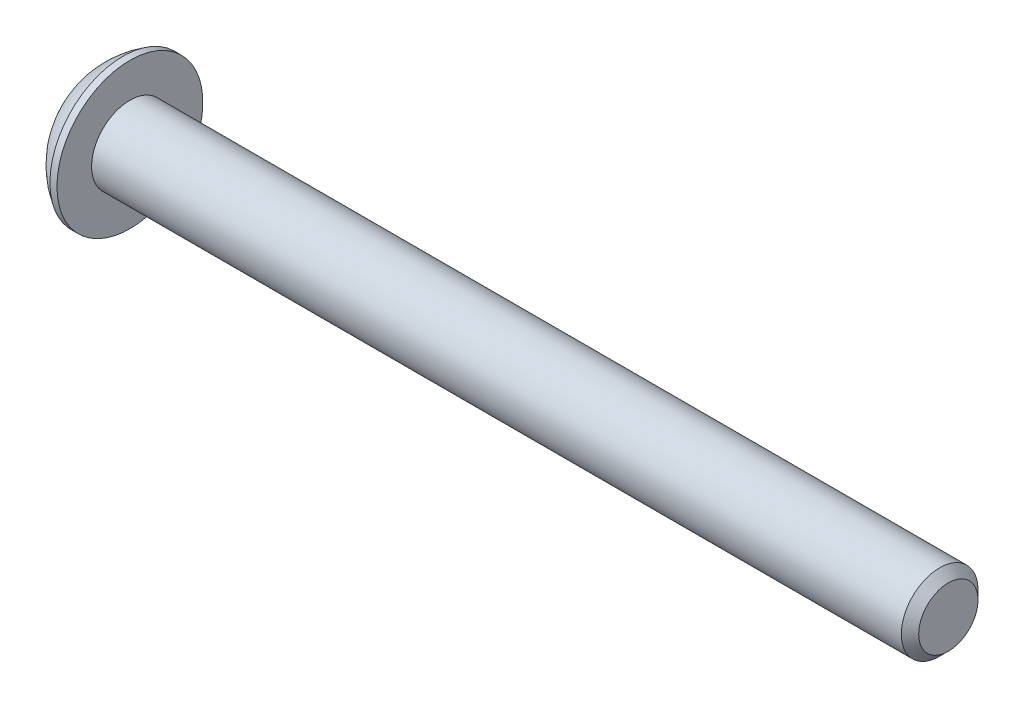
ISO-10303-21;
HEADER;
FILE_DESCRIPTION(('STEP AP214'),'2;1');
FILE_NAME('part.step','',(''),(''),'','','');
FILE_SCHEMA(('AUTOMOTIVE_DESIGN { 1 0 10303 214 1 1 1 1 }'));
ENDSEC;
DATA;
#1=APPLICATION_CONTEXT('core data for automotive mechanical design processes');
#2=APPLICATION_PROTOCOL_DEFINITION('international standard','automotive_design',2000,#1);
#3=PRODUCT_CONTEXT('',#1,'mechanical');
#4=PRODUCT('Part','Part','',(#3));
#5=PRODUCT_RELATED_PRODUCT_CATEGORY('part','',(#4));
#6=PRODUCT_DEFINITION_FORMATION('','',#4);
#7=PRODUCT_DEFINITION_CONTEXT('part definition',#1,'design');
#8=PRODUCT_DEFINITION('design','',#6,#7);
#9=PRODUCT_DEFINITION_SHAPE('','',#8);
#10=(LENGTH_UNIT() NAMED_UNIT(*) SI_UNIT(.MILLI.,.METRE.));
#11=(NAMED_UNIT(*) PLANE_ANGLE_UNIT() SI_UNIT($,.RADIAN.));
#12=(NAMED_UNIT(*) SI_UNIT($,.STERADIAN.) SOLID_ANGLE_UNIT());
#13=UNCERTAINTY_MEASURE_WITH_UNIT(LENGTH_MEASURE(1.E-05),#10,'distance_accuracy_value','');
#14=(GEOMETRIC_REPRESENTATION_CONTEXT(3) GLOBAL_UNCERTAINTY_ASSIGNED_CONTEXT((#13)) GLOBAL_UNIT_ASSIGNED_CONTEXT((#10,
#11,#12)) REPRESENTATION_CONTEXT('',''));
#15=CARTESIAN_POINT('',(0.,0.,0.));
#16=DIRECTION('',(0.,0.,1.));
#17=DIRECTION('',(1.,0.,0.));
#18=AXIS2_PLACEMENT_3D('',#15,#16,#17);
#19=CARTESIAN_POINT('',(1.32079999432833,0.,0.));
#20=DIRECTION('',(-1.,0.,0.));
#21=DIRECTION('',(0.,0.,1.));
#22=AXIS2_PLACEMENT_3D('',#19,#20,#21);
#23=CONICAL_SURFACE('',#22,1.19379999672553,1.04719755119985);
#24=CARTESIAN_POINT('',(2.01004074379096,0.,-4.44089209850063E-13));
#25=VERTEX_POINT('',#24);
#26=VERTEX_LOOP('',#25);
#27=FACE_BOUND('',#26,.T.);
#28=CARTESIAN_POINT('',(1.3207999943284,0.,0.));
#29=DIRECTION('',(-1.,0.,0.));
#30=DIRECTION('',(0.,0.,1.));
#31=AXIS2_PLACEMENT_3D('',#28,#29,#30);
#32=CIRCLE('',#31,1.19379999672553);
#33=CARTESIAN_POINT('',(1.3207999971642,0.,1.19379999836265));
#34=VERTEX_POINT('',#33);
#35=CARTESIAN_POINT('',(1.3207999971635,-1.03386112562127,0.596899999183897));
#36=VERTEX_POINT('',#35);
#37=EDGE_CURVE('E20',#34,#36,#32,.F.);
#38=ORIENTED_EDGE('',*,*,#37,.F.);
#39=CARTESIAN_POINT('',(1.32079999432935,0.,0.));
#40=DIRECTION('',(-1.,0.,0.));
#41=DIRECTION('',(0.,0.,1.));
#42=AXIS2_PLACEMENT_3D('',#39,#40,#41);
#43=CIRCLE('',#42,1.19379999672375);
#44=CARTESIAN_POINT('',(1.32079999716468,1.03386112583355,0.59689999881021));
#45=VERTEX_POINT('',#44);
#46=EDGE_CURVE('E153',#45,#34,#43,.F.);
#47=ORIENTED_EDGE('',*,*,#46,.F.);
#48=CARTESIAN_POINT('',(1.32079999432948,0.,0.));
#49=DIRECTION('',(-1.,0.,0.));
#50=DIRECTION('',(0.,0.,1.));
#51=AXIS2_PLACEMENT_3D('',#48,#49,#50);
#52=CIRCLE('',#51,1.19379999672353);
#53=CARTESIAN_POINT('',(1.32079999716474,1.03386112540457,-0.5968999995548));
#54=VERTEX_POINT('',#53);
#55=EDGE_CURVE('E460',#54,#45,#52,.F.);
#56=ORIENTED_EDGE('',*,*,#55,.F.);
#57=CARTESIAN_POINT('',(1.32079999432833,0.,0.));
#58=DIRECTION('',(-1.,0.,0.));
#59=DIRECTION('',(0.,0.,1.));
#60=AXIS2_PLACEMENT_3D('',#57,#58,#59);
#61=CIRCLE('',#60,1.19379999672553);
#62=CARTESIAN_POINT('',(1.32079999716416,0.,-1.19379999836277));
#63=VERTEX_POINT('',#62);
#64=EDGE_CURVE('E461',#63,#54,#61,.F.);
#65=ORIENTED_EDGE('',*,*,#64,.F.);
#66=CARTESIAN_POINT('',(1.32079999432699,0.,0.));
#67=DIRECTION('',(-1.,0.,0.));
#68=DIRECTION('',(0.,0.,1.));
#69=AXIS2_PLACEMENT_3D('',#66,#67,#68);
#70=CIRCLE('',#69,1.19379999672797);
#71=CARTESIAN_POINT('',(1.3207999971635,-1.03386112562049,-0.596899999183447));
#72=VERTEX_POINT('',#71);
#73=EDGE_CURVE('E463',#72,#63,#70,.F.);
#74=ORIENTED_EDGE('',*,*,#73,.F.);
#75=CARTESIAN_POINT('',(1.32079999432699,0.,0.));
#76=DIRECTION('',(-1.,0.,0.));
#77=DIRECTION('',(0.,0.,1.));
#78=AXIS2_PLACEMENT_3D('',#75,#76,#77);
#79=CIRCLE('',#78,1.19379999672797);
#80=EDGE_CURVE('E467',#36,#72,#79,.F.);
#81=ORIENTED_EDGE('',*,*,#80,.F.);
#82=EDGE_LOOP('',(#38,#47,#56,#65,#74,#81));
#83=FACE_BOUND('',#82,.T.);
#84=ADVANCED_FACE('F17',(#27,#83),#23,.F.);
#85=CARTESIAN_POINT('',(1.3208,0.,2.3876));
#86=DIRECTION('',(-1.,0.,0.));
#87=DIRECTION('',(0.,0.,1.));
#88=AXIS2_PLACEMENT_3D('',#85,#86,#87);
#89=PLANE('',#88);
#90=DIRECTION('',(0.,1.,0.));
#91=VECTOR('',#90,1.);
#92=CARTESIAN_POINT('',(1.3208,-0.689240751359,1.1938));
#93=LINE('',#92,#91);
#94=CARTESIAN_POINT('',(1.3208,-0.6892407512056,1.193800000115));
#95=VERTEX_POINT('',#94);
#96=EDGE_CURVE('E152',#34,#95,#93,.F.);
#97=ORIENTED_EDGE('',*,*,#96,.F.);
#98=ORIENTED_EDGE('',*,*,#37,.T.);
#99=DIRECTION('',(0.,0.50000000000019,0.866025403784329));
#100=VECTOR('',#99,1.);
#101=CARTESIAN_POINT('',(1.3208,-1.37848150272,0.));
#102=LINE('',#101,#100);
#103=EDGE_CURVE('E198',#95,#36,#102,.F.);
#104=ORIENTED_EDGE('',*,*,#103,.F.);
#105=EDGE_LOOP('',(#97,#98,#104));
#106=FACE_BOUND('',#105,.T.);
#107=ADVANCED_FACE('F277',(#106),#89,.T.);
#108=CARTESIAN_POINT('',(1.3208,0.,2.3876));
#109=DIRECTION('',(-1.,0.,0.));
#110=DIRECTION('',(0.,0.,1.));
#111=AXIS2_PLACEMENT_3D('',#108,#109,#110);
#112=PLANE('',#111);
#113=DIRECTION('',(0.,0.50000000000019,0.866025403784329));
#114=VECTOR('',#113,1.);
#115=CARTESIAN_POINT('',(1.3208,-1.37848150272,0.));
#116=LINE('',#115,#114);
#117=CARTESIAN_POINT('',(1.3208,-1.37848150281737,2.02535634297404E-10));
#118=VERTEX_POINT('',#117);
#119=EDGE_CURVE('E195',#36,#118,#116,.F.);
#120=ORIENTED_EDGE('',*,*,#119,.F.);
#121=ORIENTED_EDGE('',*,*,#80,.T.);
#122=DIRECTION('',(0.,-0.50000000000019,0.866025403784329));
#123=VECTOR('',#122,1.);
#124=CARTESIAN_POINT('',(1.3208,-0.689240751359,-1.1938));
#125=LINE('',#124,#123);
#126=EDGE_CURVE('E183',#118,#72,#125,.F.);
#127=ORIENTED_EDGE('',*,*,#126,.F.);
#128=EDGE_LOOP('',(#120,#121,#127));
#129=FACE_BOUND('',#128,.T.);
#130=ADVANCED_FACE('F274',(#129),#112,.T.);
#131=CARTESIAN_POINT('',(1.3208,0.,2.3876));
#132=DIRECTION('',(-1.,0.,0.));
#133=DIRECTION('',(0.,0.,1.));
#134=AXIS2_PLACEMENT_3D('',#131,#132,#133);
#135=PLANE('',#134);
#136=DIRECTION('',(0.,-0.50000000000019,0.866025403784329));
#137=VECTOR('',#136,1.);
#138=CARTESIAN_POINT('',(1.3208,-0.689240751359,-1.1938));
#139=LINE('',#138,#137);
#140=CARTESIAN_POINT('',(1.3208,-0.689240751582438,-1.19379999998452));
#141=VERTEX_POINT('',#140);
#142=EDGE_CURVE('E180',#72,#141,#139,.F.);
#143=ORIENTED_EDGE('',*,*,#142,.F.);
#144=ORIENTED_EDGE('',*,*,#73,.T.);
#145=DIRECTION('',(0.,-1.,0.));
#146=VECTOR('',#145,1.);
#147=CARTESIAN_POINT('',(1.3208,0.689240751359,-1.1938));
#148=LINE('',#147,#146);
#149=EDGE_CURVE('E169',#141,#63,#148,.F.);
#150=ORIENTED_EDGE('',*,*,#149,.F.);
#151=EDGE_LOOP('',(#143,#144,#150));
#152=FACE_BOUND('',#151,.T.);
#153=ADVANCED_FACE('F270',(#152),#135,.T.);
#154=CARTESIAN_POINT('',(1.3208,0.,2.3876));
#155=DIRECTION('',(-1.,0.,0.));
#156=DIRECTION('',(0.,0.,1.));
#157=AXIS2_PLACEMENT_3D('',#154,#155,#156);
#158=PLANE('',#157);
#159=DIRECTION('',(0.,-1.,0.));
#160=VECTOR('',#159,1.);
#161=CARTESIAN_POINT('',(1.3208,0.689240751359,-1.1938));
#162=LINE('',#161,#160);
#163=CARTESIAN_POINT('',(1.3208,0.689240751304142,-1.19380000008397));
#164=VERTEX_POINT('',#163);
#165=EDGE_CURVE('E166',#63,#164,#162,.F.);
#166=ORIENTED_EDGE('',*,*,#165,.F.);
#167=ORIENTED_EDGE('',*,*,#64,.T.);
#168=DIRECTION('',(0.,-0.50000000000019,-0.866025403784329));
#169=VECTOR('',#168,1.);
#170=CARTESIAN_POINT('',(1.3208,1.37848150272,0.));
#171=LINE('',#170,#169);
#172=EDGE_CURVE('E157',#164,#54,#171,.F.);
#173=ORIENTED_EDGE('',*,*,#172,.F.);
#174=EDGE_LOOP('',(#166,#167,#173));
#175=FACE_BOUND('',#174,.T.);
#176=ADVANCED_FACE('F266',(#175),#158,.T.);
#177=CARTESIAN_POINT('',(1.3208,0.,2.3876));
#178=DIRECTION('',(-1.,0.,0.));
#179=DIRECTION('',(0.,0.,1.));
#180=AXIS2_PLACEMENT_3D('',#177,#178,#179);
#181=PLANE('',#180);
#182=DIRECTION('',(0.,-0.50000000000019,-0.866025403784329));
#183=VECTOR('',#182,1.);
#184=CARTESIAN_POINT('',(1.3208,1.37848150272,0.));
#185=LINE('',#184,#183);
#186=CARTESIAN_POINT('',(1.3208,1.37848150281737,-2.02535824126702E-10));
#187=VERTEX_POINT('',#186);
#188=EDGE_CURVE('E108',#54,#187,#185,.F.);
#189=ORIENTED_EDGE('',*,*,#188,.F.);
#190=ORIENTED_EDGE('',*,*,#55,.T.);
#191=DIRECTION('',(0.,0.50000000000019,-0.866025403784329));
#192=VECTOR('',#191,1.);
#193=CARTESIAN_POINT('',(1.3208,0.689240751359,1.1938));
#194=LINE('',#193,#192);
#195=EDGE_CURVE('E137',#187,#45,#194,.F.);
#196=ORIENTED_EDGE('',*,*,#195,.F.);
#197=EDGE_LOOP('',(#189,#190,#196));
#198=FACE_BOUND('',#197,.T.);
#199=ADVANCED_FACE('F262',(#198),#181,.T.);
#200=CARTESIAN_POINT('',(1.3208,0.,2.3876));
#201=DIRECTION('',(-1.,0.,0.));
#202=DIRECTION('',(0.,0.,1.));
#203=AXIS2_PLACEMENT_3D('',#200,#201,#202);
#204=PLANE('',#203);
#205=DIRECTION('',(0.,0.50000000000019,-0.866025403784329));
#206=VECTOR('',#205,1.);
#207=CARTESIAN_POINT('',(1.3208,0.689240751359,1.1938));
#208=LINE('',#207,#206);
#209=CARTESIAN_POINT('',(1.3208,0.689240751385812,1.19379999996904));
#210=VERTEX_POINT('',#209);
#211=EDGE_CURVE('E139',#45,#210,#208,.F.);
#212=ORIENTED_EDGE('',*,*,#211,.F.);
#213=ORIENTED_EDGE('',*,*,#46,.T.);
#214=DIRECTION('',(0.,1.,0.));
#215=VECTOR('',#214,1.);
#216=CARTESIAN_POINT('',(1.3208,-0.689240751359,1.1938));
#217=LINE('',#216,#215);
#218=EDGE_CURVE('E149',#210,#34,#217,.F.);
#219=ORIENTED_EDGE('',*,*,#218,.F.);
#220=EDGE_LOOP('',(#212,#213,#219));
#221=FACE_BOUND('',#220,.T.);
#222=ADVANCED_FACE('F258',(#221),#204,.T.);
#223=CARTESIAN_POINT('',(1.3208,-0.689240751359,1.1938));
#224=DIRECTION('',(0.,0.,-1.));
#225=DIRECTION('',(0.,1.,0.));
#226=AXIS2_PLACEMENT_3D('',#223,#224,#225);
#227=PLANE('',#226);
#228=DIRECTION('',(0.,1.,0.));
#229=VECTOR('',#228,1.);
#230=CARTESIAN_POINT('',(0.,0.,1.19380000047));
#231=LINE('',#230,#229);
#232=CARTESIAN_POINT('',(0.,0.68924075168075,1.1938000001175));
#233=VERTEX_POINT('',#232);
#234=CARTESIAN_POINT('',(0.,-0.689240751227573,1.19380000015941));
#235=VERTEX_POINT('',#234);
#236=EDGE_CURVE('E111',#233,#235,#231,.F.);
#237=ORIENTED_EDGE('',*,*,#236,.F.);
#238=DIRECTION('',(1.,0.,0.));
#239=VECTOR('',#238,1.);
#240=CARTESIAN_POINT('',(1.3208,0.689240751359,1.1938));
#241=LINE('',#240,#239);
#242=EDGE_CURVE('E112',#210,#233,#241,.F.);
#243=ORIENTED_EDGE('',*,*,#242,.F.);
#244=ORIENTED_EDGE('',*,*,#218,.T.);
#245=ORIENTED_EDGE('',*,*,#96,.T.);
#246=DIRECTION('',(1.,0.,0.));
#247=VECTOR('',#246,1.);
#248=CARTESIAN_POINT('',(1.3208,-0.689240751264291,1.19380000016764));
#249=LINE('',#248,#247);
#250=EDGE_CURVE('E192',#235,#95,#249,.T.);
#251=ORIENTED_EDGE('',*,*,#250,.F.);
#252=EDGE_LOOP('',(#237,#243,#244,#245,#251));
#253=FACE_BOUND('',#252,.T.);
#254=ADVANCED_FACE('F254',(#253),#227,.T.);
#255=CARTESIAN_POINT('',(1.3208,-1.37848150272,0.));
#256=DIRECTION('',(0.,0.866025403784329,-0.50000000000019));
#257=DIRECTION('',(0.,0.50000000000019,0.866025403784329));
#258=AXIS2_PLACEMENT_3D('',#255,#256,#257);
#259=PLANE('',#258);
#260=DIRECTION('',(0.,-0.500000000088179,-0.866025403733529));
#261=VECTOR('',#260,1.);
#262=CARTESIAN_POINT('',(0.,-0.689240751788,1.19380000047));
#263=LINE('',#262,#261);
#264=CARTESIAN_POINT('',(0.,-1.37848150298836,9.33224186458045E-11));
#265=VERTEX_POINT('',#264);
#266=EDGE_CURVE('E133',#235,#265,#263,.T.);
#267=ORIENTED_EDGE('',*,*,#266,.F.);
#268=ORIENTED_EDGE('',*,*,#250,.T.);
#269=ORIENTED_EDGE('',*,*,#103,.T.);
#270=ORIENTED_EDGE('',*,*,#119,.T.);
#271=DIRECTION('',(1.,0.,0.));
#272=VECTOR('',#271,1.);
#273=CARTESIAN_POINT('',(1.3208,-1.37848150293344,3.73289723784587E-10));
#274=LINE('',#273,#272);
#275=EDGE_CURVE('E177',#265,#118,#274,.T.);
#276=ORIENTED_EDGE('',*,*,#275,.F.);
#277=EDGE_LOOP('',(#267,#268,#269,#270,#276));
#278=FACE_BOUND('',#277,.T.);
#279=ADVANCED_FACE('F250',(#278),#259,.T.);
#280=CARTESIAN_POINT('',(1.3208,-0.689240751359,-1.1938));
#281=DIRECTION('',(0.,0.866025403784329,0.50000000000019));
#282=DIRECTION('',(0.,-0.50000000000019,0.866025403784329));
#283=AXIS2_PLACEMENT_3D('',#280,#281,#282);
#284=PLANE('',#283);
#285=DIRECTION('',(0.,0.500000000088179,-0.866025403733529));
#286=VECTOR('',#285,1.);
#287=CARTESIAN_POINT('',(0.,-1.37848150358,0.));
#288=LINE('',#287,#286);
#289=CARTESIAN_POINT('',(0.,-0.6892407515735,-1.1938000001175));
#290=VERTEX_POINT('',#289);
#291=EDGE_CURVE('E128',#265,#290,#288,.T.);
#292=ORIENTED_EDGE('',*,*,#291,.F.);
#293=ORIENTED_EDGE('',*,*,#275,.T.);
#294=ORIENTED_EDGE('',*,*,#126,.T.);
#295=ORIENTED_EDGE('',*,*,#142,.T.);
#296=DIRECTION('',(1.,0.,0.));
#297=VECTOR('',#296,1.);
#298=CARTESIAN_POINT('',(1.3208,-0.689240751788,-1.1938));
#299=LINE('',#298,#297);
#300=EDGE_CURVE('E163',#290,#141,#299,.T.);
#301=ORIENTED_EDGE('',*,*,#300,.F.);
#302=EDGE_LOOP('',(#292,#293,#294,#295,#301));
#303=FACE_BOUND('',#302,.T.);
#304=ADVANCED_FACE('F246',(#303),#284,.T.);
#305=CARTESIAN_POINT('',(1.3208,0.689240751359,-1.1938));
#306=DIRECTION('',(0.,0.,1.));
#307=DIRECTION('',(0.,-1.,0.));
#308=AXIS2_PLACEMENT_3D('',#305,#306,#307);
#309=PLANE('',#308);
#310=DIRECTION('',(0.,1.,0.));
#311=VECTOR('',#310,1.);
#312=CARTESIAN_POINT('',(0.,0.,-1.19380000047));
#313=LINE('',#312,#311);
#314=CARTESIAN_POINT('',(0.,0.689240751442573,-1.19380000015941));
#315=VERTEX_POINT('',#314);
#316=EDGE_CURVE('E126',#290,#315,#313,.T.);
#317=ORIENTED_EDGE('',*,*,#316,.F.);
#318=ORIENTED_EDGE('',*,*,#300,.T.);
#319=ORIENTED_EDGE('',*,*,#149,.T.);
#320=ORIENTED_EDGE('',*,*,#165,.T.);
#321=DIRECTION('',(1.,0.,0.));
#322=VECTOR('',#321,1.);
#323=CARTESIAN_POINT('',(1.3208,0.689240751264291,-1.19380000016764));
#324=LINE('',#323,#322);
#325=EDGE_CURVE('E140',#315,#164,#324,.T.);
#326=ORIENTED_EDGE('',*,*,#325,.F.);
#327=EDGE_LOOP('',(#317,#318,#319,#320,#326));
#328=FACE_BOUND('',#327,.T.);
#329=ADVANCED_FACE('F243',(#328),#309,.T.);
#330=CARTESIAN_POINT('',(1.3208,1.37848150272,0.));
#331=DIRECTION('',(0.,-0.866025403784329,0.50000000000019));
#332=DIRECTION('',(0.,-0.50000000000019,-0.866025403784329));
#333=AXIS2_PLACEMENT_3D('',#330,#331,#332);
#334=PLANE('',#333);
#335=DIRECTION('',(0.,0.500000000088179,0.866025403733529));
#336=VECTOR('',#335,1.);
#337=CARTESIAN_POINT('',(0.,0.689240751788,-1.19380000047));
#338=LINE('',#337,#336);
#339=CARTESIAN_POINT('',(0.,1.37848150298836,-9.33226360497484E-11));
#340=VERTEX_POINT('',#339);
#341=EDGE_CURVE('E104',#315,#340,#338,.T.);
#342=ORIENTED_EDGE('',*,*,#341,.F.);
#343=ORIENTED_EDGE('',*,*,#325,.T.);
#344=ORIENTED_EDGE('',*,*,#172,.T.);
#345=ORIENTED_EDGE('',*,*,#188,.T.);
#346=DIRECTION('',(1.,0.,0.));
#347=VECTOR('',#346,1.);
#348=CARTESIAN_POINT('',(1.3208,1.37848150293344,-3.73289723784587E-10));
#349=LINE('',#348,#347);
#350=EDGE_CURVE('E99',#340,#187,#349,.T.);
#351=ORIENTED_EDGE('',*,*,#350,.F.);
#352=EDGE_LOOP('',(#342,#343,#344,#345,#351));
#353=FACE_BOUND('',#352,.T.);
#354=ADVANCED_FACE('F101',(#353),#334,.T.);
#355=CARTESIAN_POINT('',(1.3208,0.689240751359,1.1938));
#356=DIRECTION('',(0.,-0.866025403784329,-0.50000000000019));
#357=DIRECTION('',(0.,0.50000000000019,-0.866025403784329));
#358=AXIS2_PLACEMENT_3D('',#355,#356,#357);
#359=PLANE('',#358);
#360=DIRECTION('',(0.,-0.500000000088179,0.866025403733529));
#361=VECTOR('',#360,1.);
#362=CARTESIAN_POINT('',(0.,1.37848150358,0.));
#363=LINE('',#362,#361);
#364=EDGE_CURVE('E116',#340,#233,#363,.T.);
#365=ORIENTED_EDGE('',*,*,#364,.F.);
#366=ORIENTED_EDGE('',*,*,#350,.T.);
#367=ORIENTED_EDGE('',*,*,#195,.T.);
#368=ORIENTED_EDGE('',*,*,#211,.T.);
#369=ORIENTED_EDGE('',*,*,#242,.T.);
#370=EDGE_LOOP('',(#365,#366,#367,#368,#369));
#371=FACE_BOUND('',#370,.T.);
#372=ADVANCED_FACE('F117',(#371),#359,.T.);
#373=CARTESIAN_POINT('',(0.,0.,0.));
#374=DIRECTION('',(-1.,0.,0.));
#375=DIRECTION('',(0.,0.,1.));
#376=AXIS2_PLACEMENT_3D('',#373,#374,#375);
#377=PLANE('',#376);
#378=ORIENTED_EDGE('',*,*,#341,.T.);
#379=ORIENTED_EDGE('',*,*,#364,.T.);
#380=ORIENTED_EDGE('',*,*,#236,.T.);
#381=ORIENTED_EDGE('',*,*,#266,.T.);
#382=ORIENTED_EDGE('',*,*,#291,.T.);
#383=ORIENTED_EDGE('',*,*,#316,.T.);
#384=EDGE_LOOP('',(#378,#379,#380,#381,#382,#383));
#385=FACE_BOUND('',#384,.T.);
#386=CARTESIAN_POINT('',(0.,0.,1.98119999998985));
#387=CARTESIAN_POINT('',(0.,-0.0557390650399789,1.98120055660966));
#388=CARTESIAN_POINT('',(0.,-0.111453432117481,1.97884663138686));
#389=CARTESIAN_POINT('',(0.,-0.222480502064213,1.96945704071447));
#390=CARTESIAN_POINT('',(0.,-0.277793245233554,1.9624218517474));
#391=CARTESIAN_POINT('',(0.,-0.442446102081732,1.93436375298367));
#392=CARTESIAN_POINT('',(0.,-0.550677183213,1.90638812171637));
#393=CARTESIAN_POINT('',(0.,-0.760950126034855,1.83262880316702));
#394=CARTESIAN_POINT('',(0.,-0.862988973863703,1.78683652332502));
#395=CARTESIAN_POINT('',(0.,-1.00908498014284,1.70587511177058));
#396=CARTESIAN_POINT('',(0.,-1.05662700378396,1.67683949621983));
#397=CARTESIAN_POINT('',(0.,-1.14914578466578,1.61484398921831));
#398=CARTESIAN_POINT('',(0.,-1.19412004018535,1.5818803641383));
#399=CARTESIAN_POINT('',(0.,-1.32457627759885,1.47750803486586));
#400=CARTESIAN_POINT('',(0.,-1.40571396425623,1.40054998056059));
#401=CARTESIAN_POINT('',(0.,-1.55389691423634,1.23408798466257));
#402=CARTESIAN_POINT('',(0.,-1.62094239958562,1.1445842407677));
#403=CARTESIAN_POINT('',(0.,-1.70952543394655,1.00289429614648));
#404=CARTESIAN_POINT('',(0.,-1.73707627063435,0.954375057469357));
#405=CARTESIAN_POINT('',(0.,-1.78797433303939,0.855219375207081));
#406=CARTESIAN_POINT('',(0.,-1.81132527423523,0.804584852291461));
#407=CARTESIAN_POINT('',(0.,-1.85366064120168,0.70156653445966));
#408=CARTESIAN_POINT('',(0.,-1.87264815473363,0.649184006760051));
#409=CARTESIAN_POINT('',(0.,-1.90614549304587,0.543012423064654));
#410=CARTESIAN_POINT('',(0.,-1.92065542599135,0.489223401079687));
#411=CARTESIAN_POINT('',(0.,-1.94891476943951,0.363619214214866));
#412=CARTESIAN_POINT('',(0.,-1.96100930133067,0.291424078260064));
#413=CARTESIAN_POINT('',(0.,-1.97715401677114,0.146164130151162));
#414=CARTESIAN_POINT('',(0.,-1.98120403127284,0.0730992997537467));
#415=CARTESIAN_POINT('',(0.,-1.98119386246079,-0.11129188347224));
#416=CARTESIAN_POINT('',(-2.36461912593277E-13,-1.97179072550375,-0.222663664542813));
#417=CARTESIAN_POINT('',(2.3758679546678E-13,-1.93440961204789,-0.442327109070763));
#418=CARTESIAN_POINT('',(8.97607388947037E-13,-1.90641145458511,-0.550615292627718));
#419=CARTESIAN_POINT('',(7.96467138425405E-13,-1.83263945639612,-0.760915131148869));
#420=CARTESIAN_POINT('',(0.,-1.78687341763558,-0.862929518224405));
#421=CARTESIAN_POINT('',(0.,-1.67887365240873,-1.05780237510717));
#422=CARTESIAN_POINT('',(6.54195955855842E-13,-1.61664336567415,-1.15066275182616));
#423=CARTESIAN_POINT('',(7.75816519468785E-13,-1.47747368988577,-1.32462579830268));
#424=CARTESIAN_POINT('',(2.0810329501915E-13,-1.40053332871178,-1.40572769037364));
#425=CARTESIAN_POINT('',(-2.07251836358626E-13,-1.23412005623458,-1.5538694614116));
#426=CARTESIAN_POINT('',(0.,-1.14464618565567,-1.62090826305174));
#427=CARTESIAN_POINT('',(0.,-0.95570289629078,-1.73902439945656));
#428=CARTESIAN_POINT('',(0.,-0.856231285623353,-1.79009822396485));
#429=CARTESIAN_POINT('',(0.,-0.6501377561964,-1.87479823910519));
#430=CARTESIAN_POINT('',(0.,-0.543519552724991,-1.908433417305));
#431=CARTESIAN_POINT('',(0.,-0.363538118200779,-1.9489370008476));
#432=CARTESIAN_POINT('',(0.,-0.291307136907192,-1.96102881729719));
#433=CARTESIAN_POINT('',(0.,-0.146060819666958,-1.977158966732));
#434=CARTESIAN_POINT('',(0.,-0.0730468144088217,-1.98120928571539));
#435=CARTESIAN_POINT('',(0.,0.,-1.98119999998985));
#436=B_SPLINE_CURVE_WITH_KNOTS('',3,(#386,#387,#388,#389,#390,#391,#392,#393,#394,#395,#396,
#397,#398,#399,#400,#401,#402,#403,#404,#405,#406,#407,#408,#409,#410,#411,#412,#413,#414,#415,
#416,#417,#418,#419,#420,#421,#422,#423,#424,#425,#426,#427,#428,#429,#430,#431,#432,#433,#434,
#435),.UNSPECIFIED.,.F.,.F.,(4,2,2,2,2,2,2,2,2,2,2,2,2,2,2,2,2,2,2,2,2,2,2,2,4),(0.,
0.167118495181553,0.334219982805217,0.667900732740854,1.00174260910518,1.16869183543993,
1.33580103455313,1.66960535041727,2.00340440670744,2.1706255760741,2.33769807606219,
2.50465198130918,2.67160185312499,2.89072746136433,3.10985767426375,3.44347802632463,
3.7774610457135,4.1112975770546,4.44506441784141,4.77885332335038,5.11266778999329,
5.44655560165061,5.78027116198891,5.9995626243884,6.21852698275403),.UNSPECIFIED.);
#437=CARTESIAN_POINT('',(0.,0.,1.98119999998985));
#438=VERTEX_POINT('',#437);
#439=CARTESIAN_POINT('',(0.,0.,-1.98119999998985));
#440=VERTEX_POINT('',#439);
#441=EDGE_CURVE('E34',#438,#440,#436,.T.);
#442=ORIENTED_EDGE('',*,*,#441,.F.);
#443=CARTESIAN_POINT('',(0.,0.,0.));
#444=DIRECTION('',(-1.,0.,0.));
#445=DIRECTION('',(0.,-1.,0.));
#446=AXIS2_PLACEMENT_3D('',#443,#444,#445);
#447=CIRCLE('',#446,1.98119999998985);
#448=EDGE_CURVE('E224',#440,#438,#447,.F.);
#449=ORIENTED_EDGE('',*,*,#448,.F.);
#450=EDGE_LOOP('',(#442,#449));
#451=FACE_BOUND('',#450,.T.);
#452=ADVANCED_FACE('F123',(#385,#451),#377,.T.);
#453=CARTESIAN_POINT('',(4.13385,0.,0.));
#454=DIRECTION('',(-1.,0.,0.));
#455=DIRECTION('',(0.,1.,0.));
#456=AXIS2_PLACEMENT_3D('',#453,#454,#455);
#457=SPHERICAL_SURFACE('',#456,4.58408870578);
#458=ORIENTED_EDGE('',*,*,#448,.T.);
#459=ORIENTED_EDGE('',*,*,#441,.T.);
#460=EDGE_LOOP('',(#458,#459));
#461=FACE_BOUND('',#460,.T.);
#462=CARTESIAN_POINT('',(1.82880000025,0.,0.));
#463=DIRECTION('',(-1.,0.,0.));
#464=DIRECTION('',(0.,0.,1.));
#465=AXIS2_PLACEMENT_3D('',#462,#463,#464);
#466=CIRCLE('',#465,3.9624);
#467=CARTESIAN_POINT('',(1.82880000025,0.,3.9624));
#468=VERTEX_POINT('',#467);
#469=EDGE_CURVE('E223',#468,#468,#466,.F.);
#470=ORIENTED_EDGE('',*,*,#469,.F.);
#471=EDGE_LOOP('',(#470));
#472=FACE_BOUND('',#471,.T.);
#473=ADVANCED_FACE('F238',(#461,#472),#457,.T.);
#474=CARTESIAN_POINT('',(46.6598,0.,0.));
#475=DIRECTION('',(-1.,0.,0.));
#476=DIRECTION('',(0.,0.,1.));
#477=AXIS2_PLACEMENT_3D('',#474,#475,#476);
#478=PLANE('',#477);
#479=CARTESIAN_POINT('',(46.6597999999863,0.,0.));
#480=DIRECTION('',(-1.,0.,0.));
#481=DIRECTION('',(0.,0.,1.));
#482=AXIS2_PLACEMENT_3D('',#479,#480,#481);
#483=CIRCLE('',#482,1.61035999991555);
#484=CARTESIAN_POINT('',(46.6597999999863,0.,1.61035999991555));
#485=VERTEX_POINT('',#484);
#486=EDGE_CURVE('E220',#485,#485,#483,.T.);
#487=ORIENTED_EDGE('',*,*,#486,.F.);
#488=EDGE_LOOP('',(#487));
#489=FACE_BOUND('',#488,.T.);
#490=ADVANCED_FACE('F305',(#489),#478,.F.);
#491=CARTESIAN_POINT('',(0.,0.,0.));
#492=DIRECTION('',(-1.,0.,0.));
#493=DIRECTION('',(0.,0.,1.));
#494=AXIS2_PLACEMENT_3D('',#491,#492,#493);
#495=CYLINDRICAL_SURFACE('',#494,3.9624);
#496=ORIENTED_EDGE('',*,*,#469,.T.);
#497=EDGE_LOOP('',(#496));
#498=FACE_BOUND('',#497,.T.);
#499=CARTESIAN_POINT('',(2.20979999937,0.,0.));
#500=DIRECTION('',(-1.,0.,0.));
#501=DIRECTION('',(0.,0.,1.));
#502=AXIS2_PLACEMENT_3D('',#499,#500,#501);
#503=CIRCLE('',#502,3.9624);
#504=CARTESIAN_POINT('',(2.20979999937,0.,3.9624));
#505=VERTEX_POINT('',#504);
#506=EDGE_CURVE('E217',#505,#505,#503,.T.);
#507=ORIENTED_EDGE('',*,*,#506,.T.);
#508=EDGE_LOOP('',(#507));
#509=FACE_BOUND('',#508,.T.);
#510=ADVANCED_FACE('F301',(#498,#509),#495,.T.);
#511=CARTESIAN_POINT('',(46.1873600000331,0.,0.));
#512=DIRECTION('',(-1.,0.,0.));
#513=DIRECTION('',(0.,0.,1.));
#514=AXIS2_PLACEMENT_3D('',#511,#512,#513);
#515=CONICAL_SURFACE('',#514,2.08279999992556,0.785398163457608);
#516=CARTESIAN_POINT('',(46.18736,0.,0.));
#517=DIRECTION('',(-1.,0.,0.));
#518=DIRECTION('',(0.,0.,1.));
#519=AXIS2_PLACEMENT_3D('',#516,#517,#518);
#520=CIRCLE('',#519,2.0828);
#521=CARTESIAN_POINT('',(46.18736,0.,2.0828));
#522=VERTEX_POINT('',#521);
#523=EDGE_CURVE('E26',#522,#522,#520,.T.);
#524=ORIENTED_EDGE('',*,*,#523,.F.);
#525=EDGE_LOOP('',(#524));
#526=FACE_BOUND('',#525,.T.);
#527=ORIENTED_EDGE('',*,*,#486,.T.);
#528=EDGE_LOOP('',(#527));
#529=FACE_BOUND('',#528,.T.);
#530=ADVANCED_FACE('F294',(#526,#529),#515,.T.);
#531=CARTESIAN_POINT('',(2.2098,2.0828,0.));
#532=DIRECTION('',(-1.,0.,0.));
#533=DIRECTION('',(0.,0.,1.));
#534=AXIS2_PLACEMENT_3D('',#531,#532,#533);
#535=PLANE('',#534);
#536=CARTESIAN_POINT('',(2.20979999937,0.,0.));
#537=DIRECTION('',(-1.,0.,0.));
#538=DIRECTION('',(0.,0.,1.));
#539=AXIS2_PLACEMENT_3D('',#536,#537,#538);
#540=CIRCLE('',#539,2.0828);
#541=CARTESIAN_POINT('',(2.20979999937,0.,2.0828));
#542=VERTEX_POINT('',#541);
#543=EDGE_CURVE('E11',#542,#542,#540,.F.);
#544=ORIENTED_EDGE('',*,*,#543,.F.);
#545=EDGE_LOOP('',(#544));
#546=FACE_BOUND('',#545,.T.);
#547=ORIENTED_EDGE('',*,*,#506,.F.);
#548=EDGE_LOOP('',(#547));
#549=FACE_BOUND('',#548,.T.);
#550=ADVANCED_FACE('F288',(#546,#549),#535,.F.);
#551=CARTESIAN_POINT('',(0.,0.,0.));
#552=DIRECTION('',(-1.,0.,0.));
#553=DIRECTION('',(0.,0.,1.));
#554=AXIS2_PLACEMENT_3D('',#551,#552,#553);
#555=CYLINDRICAL_SURFACE('',#554,2.0828);
#556=ORIENTED_EDGE('',*,*,#543,.T.);
#557=EDGE_LOOP('',(#556));
#558=FACE_BOUND('',#557,.T.);
#559=ORIENTED_EDGE('',*,*,#523,.T.);
#560=EDGE_LOOP('',(#559));
#561=FACE_BOUND('',#560,.T.);
#562=ADVANCED_FACE('F286',(#558,#561),#555,.T.);
#563=CLOSED_SHELL('',(#84,#107,#130,#153,#176,#199,#222,#254,#279,#304,#329,#354,#372,#452,#473,
#490,#510,#530,#550,#562));
#564=MANIFOLD_SOLID_BREP('B1',#563);
#565=ADVANCED_BREP_SHAPE_REPRESENTATION('',(#18,#564),#14);
#566=SHAPE_DEFINITION_REPRESENTATION(#9,#565);
ENDSEC;
END-ISO-10303-21;
